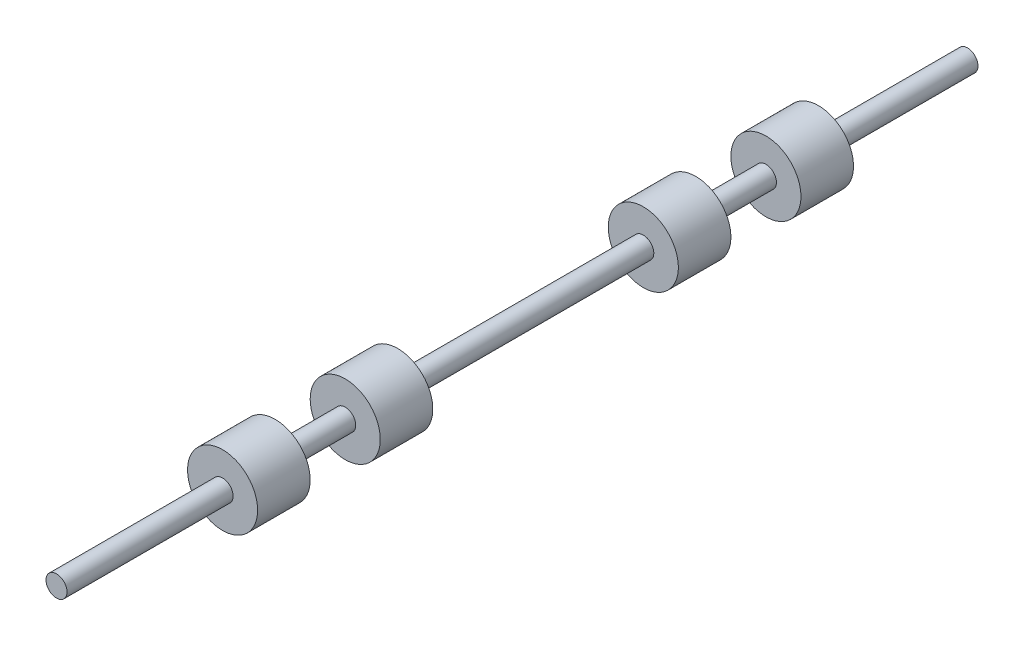
ISO-10303-21;
HEADER;
FILE_DESCRIPTION(('STEP AP214'),'2;1');
FILE_NAME('part.step','',(''),(''),'','','');
FILE_SCHEMA(('AUTOMOTIVE_DESIGN { 1 0 10303 214 1 1 1 1 }'));
ENDSEC;
DATA;
#1=APPLICATION_CONTEXT('core data for automotive mechanical design processes');
#2=APPLICATION_PROTOCOL_DEFINITION('international standard','automotive_design',2000,#1);
#3=PRODUCT_CONTEXT('',#1,'mechanical');
#4=PRODUCT('Part','Part','',(#3));
#5=PRODUCT_RELATED_PRODUCT_CATEGORY('part','',(#4));
#6=PRODUCT_DEFINITION_FORMATION('','',#4);
#7=PRODUCT_DEFINITION_CONTEXT('part definition',#1,'design');
#8=PRODUCT_DEFINITION('design','',#6,#7);
#9=PRODUCT_DEFINITION_SHAPE('','',#8);
#10=(LENGTH_UNIT() NAMED_UNIT(*) SI_UNIT(.MILLI.,.METRE.));
#11=(NAMED_UNIT(*) PLANE_ANGLE_UNIT() SI_UNIT($,.RADIAN.));
#12=(NAMED_UNIT(*) SI_UNIT($,.STERADIAN.) SOLID_ANGLE_UNIT());
#13=UNCERTAINTY_MEASURE_WITH_UNIT(LENGTH_MEASURE(1.E-05),#10,'distance_accuracy_value','');
#14=(GEOMETRIC_REPRESENTATION_CONTEXT(3) GLOBAL_UNCERTAINTY_ASSIGNED_CONTEXT((#13)) GLOBAL_UNIT_ASSIGNED_CONTEXT((#10,
#11,#12)) REPRESENTATION_CONTEXT('',''));
#15=CARTESIAN_POINT('',(0.,0.,0.));
#16=DIRECTION('',(0.,0.,1.));
#17=DIRECTION('',(1.,0.,0.));
#18=AXIS2_PLACEMENT_3D('',#15,#16,#17);
#19=CARTESIAN_POINT('',(0.,0.,26.));
#20=DIRECTION('',(0.,0.,-1.));
#21=DIRECTION('',(-1.,0.,0.));
#22=AXIS2_PLACEMENT_3D('',#19,#20,#21);
#23=CYLINDRICAL_SURFACE('',#22,0.3);
#24=CARTESIAN_POINT('',(0.,0.,17.76));
#25=DIRECTION('',(0.,0.,-1.));
#26=DIRECTION('',(-1.,0.,0.));
#27=AXIS2_PLACEMENT_3D('',#24,#25,#26);
#28=CIRCLE('',#27,0.3);
#29=CARTESIAN_POINT('',(-0.3,0.,17.76));
#30=VERTEX_POINT('',#29);
#31=EDGE_CURVE('E54',#30,#30,#28,.T.);
#32=ORIENTED_EDGE('',*,*,#31,.F.);
#33=EDGE_LOOP('',(#32));
#34=FACE_BOUND('',#33,.T.);
#35=CARTESIAN_POINT('',(0.,0.,19.76));
#36=DIRECTION('',(0.,0.,1.));
#37=DIRECTION('',(1.,0.,0.));
#38=AXIS2_PLACEMENT_3D('',#35,#36,#37);
#39=CIRCLE('',#38,0.3);
#40=CARTESIAN_POINT('',(0.3,0.,19.76));
#41=VERTEX_POINT('',#40);
#42=EDGE_CURVE('E49',#41,#41,#39,.T.);
#43=ORIENTED_EDGE('',*,*,#42,.F.);
#44=EDGE_LOOP('',(#43));
#45=FACE_BOUND('',#44,.T.);
#46=ADVANCED_FACE('F41',(#34,#45),#23,.T.);
#47=CARTESIAN_POINT('',(0.,0.,9.253));
#48=DIRECTION('',(0.,0.,-1.));
#49=DIRECTION('',(-1.,0.,0.));
#50=AXIS2_PLACEMENT_3D('',#47,#48,#49);
#51=CIRCLE('',#50,0.3);
#52=CARTESIAN_POINT('',(-0.3,0.,9.253));
#53=VERTEX_POINT('',#52);
#54=EDGE_CURVE('E65',#53,#53,#51,.T.);
#55=ORIENTED_EDGE('',*,*,#54,.F.);
#56=EDGE_LOOP('',(#55));
#57=FACE_BOUND('',#56,.T.);
#58=CARTESIAN_POINT('',(0.,0.,16.26));
#59=DIRECTION('',(0.,0.,1.));
#60=DIRECTION('',(1.,0.,0.));
#61=AXIS2_PLACEMENT_3D('',#58,#59,#60);
#62=CIRCLE('',#61,0.3);
#63=CARTESIAN_POINT('',(0.3,0.,16.26));
#64=VERTEX_POINT('',#63);
#65=EDGE_CURVE('E59',#64,#64,#62,.T.);
#66=ORIENTED_EDGE('',*,*,#65,.F.);
#67=EDGE_LOOP('',(#66));
#68=FACE_BOUND('',#67,.T.);
#69=ADVANCED_FACE('F141',(#57,#68),#23,.T.);
#70=CARTESIAN_POINT('',(0.,0.,5.753));
#71=DIRECTION('',(0.,0.,-1.));
#72=DIRECTION('',(-1.,0.,0.));
#73=AXIS2_PLACEMENT_3D('',#70,#71,#72);
#74=CIRCLE('',#73,0.3);
#75=CARTESIAN_POINT('',(-0.3,0.,5.753));
#76=VERTEX_POINT('',#75);
#77=EDGE_CURVE('E73',#76,#76,#74,.T.);
#78=ORIENTED_EDGE('',*,*,#77,.F.);
#79=EDGE_LOOP('',(#78));
#80=FACE_BOUND('',#79,.T.);
#81=CARTESIAN_POINT('',(0.,0.,7.753));
#82=DIRECTION('',(0.,0.,1.));
#83=DIRECTION('',(1.,0.,0.));
#84=AXIS2_PLACEMENT_3D('',#81,#82,#83);
#85=CIRCLE('',#84,0.3);
#86=CARTESIAN_POINT('',(0.3,0.,7.753));
#87=VERTEX_POINT('',#86);
#88=EDGE_CURVE('E69',#87,#87,#85,.T.);
#89=ORIENTED_EDGE('',*,*,#88,.F.);
#90=EDGE_LOOP('',(#89));
#91=FACE_BOUND('',#90,.T.);
#92=ADVANCED_FACE('F146',(#80,#91),#23,.T.);
#93=CARTESIAN_POINT('',(0.,0.,5.753));
#94=DIRECTION('',(0.,0.,-1.));
#95=DIRECTION('',(-1.,0.,0.));
#96=AXIS2_PLACEMENT_3D('',#93,#94,#95);
#97=PLANE('',#96);
#98=ORIENTED_EDGE('',*,*,#77,.T.);
#99=EDGE_LOOP('',(#98));
#100=FACE_BOUND('',#99,.T.);
#101=CARTESIAN_POINT('',(0.,0.,5.753));
#102=DIRECTION('',(0.,0.,-1.));
#103=DIRECTION('',(-1.,0.,0.));
#104=AXIS2_PLACEMENT_3D('',#101,#102,#103);
#105=CIRCLE('',#104,1.);
#106=CARTESIAN_POINT('',(-1.,0.,5.753));
#107=VERTEX_POINT('',#106);
#108=EDGE_CURVE('E86',#107,#107,#105,.T.);
#109=ORIENTED_EDGE('',*,*,#108,.F.);
#110=EDGE_LOOP('',(#109));
#111=FACE_BOUND('',#110,.T.);
#112=ADVANCED_FACE('F176',(#100,#111),#97,.F.);
#113=CARTESIAN_POINT('',(0.,0.,0.));
#114=DIRECTION('',(0.,0.,-1.));
#115=DIRECTION('',(-1.,0.,0.));
#116=AXIS2_PLACEMENT_3D('',#113,#114,#115);
#117=CYLINDRICAL_SURFACE('',#116,1.);
#118=CARTESIAN_POINT('',(0.,0.,4.253));
#119=DIRECTION('',(0.,0.,-1.));
#120=DIRECTION('',(-1.,0.,0.));
#121=AXIS2_PLACEMENT_3D('',#118,#119,#120);
#122=CIRCLE('',#121,1.);
#123=CARTESIAN_POINT('',(-1.,0.,4.253));
#124=VERTEX_POINT('',#123);
#125=EDGE_CURVE('E93',#124,#124,#122,.T.);
#126=ORIENTED_EDGE('',*,*,#125,.F.);
#127=EDGE_LOOP('',(#126));
#128=FACE_BOUND('',#127,.T.);
#129=ORIENTED_EDGE('',*,*,#108,.T.);
#130=EDGE_LOOP('',(#129));
#131=FACE_BOUND('',#130,.T.);
#132=ADVANCED_FACE('F181',(#128,#131),#117,.T.);
#133=CARTESIAN_POINT('',(0.,0.,4.253));
#134=DIRECTION('',(0.,0.,1.));
#135=DIRECTION('',(1.,0.,0.));
#136=AXIS2_PLACEMENT_3D('',#133,#134,#135);
#137=PLANE('',#136);
#138=CARTESIAN_POINT('',(0.,0.,4.253));
#139=DIRECTION('',(0.,0.,1.));
#140=DIRECTION('',(1.,0.,0.));
#141=AXIS2_PLACEMENT_3D('',#138,#139,#140);
#142=CIRCLE('',#141,0.3);
#143=CARTESIAN_POINT('',(0.3,0.,4.253));
#144=VERTEX_POINT('',#143);
#145=EDGE_CURVE('E77',#144,#144,#142,.T.);
#146=ORIENTED_EDGE('',*,*,#145,.T.);
#147=EDGE_LOOP('',(#146));
#148=FACE_BOUND('',#147,.T.);
#149=ORIENTED_EDGE('',*,*,#125,.T.);
#150=EDGE_LOOP('',(#149));
#151=FACE_BOUND('',#150,.T.);
#152=ADVANCED_FACE('F172',(#148,#151),#137,.F.);
#153=CARTESIAN_POINT('',(0.,0.,0.));
#154=DIRECTION('',(0.,0.,1.));
#155=DIRECTION('',(1.,0.,0.));
#156=AXIS2_PLACEMENT_3D('',#153,#154,#155);
#157=PLANE('',#156);
#158=CARTESIAN_POINT('',(0.,0.,0.));
#159=DIRECTION('',(0.,0.,1.));
#160=DIRECTION('',(1.,0.,0.));
#161=AXIS2_PLACEMENT_3D('',#158,#159,#160);
#162=CIRCLE('',#161,0.3);
#163=CARTESIAN_POINT('',(0.3,0.,0.));
#164=VERTEX_POINT('',#163);
#165=EDGE_CURVE('E82',#164,#164,#162,.T.);
#166=ORIENTED_EDGE('',*,*,#165,.F.);
#167=EDGE_LOOP('',(#166));
#168=FACE_BOUND('',#167,.T.);
#169=ADVANCED_FACE('F163',(#168),#157,.F.);
#170=ORIENTED_EDGE('',*,*,#165,.T.);
#171=EDGE_LOOP('',(#170));
#172=FACE_BOUND('',#171,.T.);
#173=ORIENTED_EDGE('',*,*,#145,.F.);
#174=EDGE_LOOP('',(#173));
#175=FACE_BOUND('',#174,.T.);
#176=ADVANCED_FACE('F153',(#172,#175),#23,.T.);
#177=CARTESIAN_POINT('',(0.,0.,9.253));
#178=DIRECTION('',(0.,0.,-1.));
#179=DIRECTION('',(-1.,0.,0.));
#180=AXIS2_PLACEMENT_3D('',#177,#178,#179);
#181=PLANE('',#180);
#182=ORIENTED_EDGE('',*,*,#54,.T.);
#183=EDGE_LOOP('',(#182));
#184=FACE_BOUND('',#183,.T.);
#185=CARTESIAN_POINT('',(0.,0.,9.253));
#186=DIRECTION('',(0.,0.,-1.));
#187=DIRECTION('',(-1.,0.,0.));
#188=AXIS2_PLACEMENT_3D('',#185,#186,#187);
#189=CIRCLE('',#188,1.);
#190=CARTESIAN_POINT('',(-1.,0.,9.253));
#191=VERTEX_POINT('',#190);
#192=EDGE_CURVE('E97',#191,#191,#189,.T.);
#193=ORIENTED_EDGE('',*,*,#192,.F.);
#194=EDGE_LOOP('',(#193));
#195=FACE_BOUND('',#194,.T.);
#196=ADVANCED_FACE('F162',(#184,#195),#181,.F.);
#197=CARTESIAN_POINT('',(0.,0.,0.));
#198=DIRECTION('',(0.,0.,-1.));
#199=DIRECTION('',(-1.,0.,0.));
#200=AXIS2_PLACEMENT_3D('',#197,#198,#199);
#201=CYLINDRICAL_SURFACE('',#200,1.);
#202=CARTESIAN_POINT('',(0.,0.,7.753));
#203=DIRECTION('',(0.,0.,-1.));
#204=DIRECTION('',(-1.,0.,0.));
#205=AXIS2_PLACEMENT_3D('',#202,#203,#204);
#206=CIRCLE('',#205,1.);
#207=CARTESIAN_POINT('',(-1.,0.,7.753));
#208=VERTEX_POINT('',#207);
#209=EDGE_CURVE('E101',#208,#208,#206,.T.);
#210=ORIENTED_EDGE('',*,*,#209,.F.);
#211=EDGE_LOOP('',(#210));
#212=FACE_BOUND('',#211,.T.);
#213=ORIENTED_EDGE('',*,*,#192,.T.);
#214=EDGE_LOOP('',(#213));
#215=FACE_BOUND('',#214,.T.);
#216=ADVANCED_FACE('F169',(#212,#215),#201,.T.);
#217=CARTESIAN_POINT('',(0.,0.,7.753));
#218=DIRECTION('',(0.,0.,1.));
#219=DIRECTION('',(1.,0.,0.));
#220=AXIS2_PLACEMENT_3D('',#217,#218,#219);
#221=PLANE('',#220);
#222=ORIENTED_EDGE('',*,*,#88,.T.);
#223=EDGE_LOOP('',(#222));
#224=FACE_BOUND('',#223,.T.);
#225=ORIENTED_EDGE('',*,*,#209,.T.);
#226=EDGE_LOOP('',(#225));
#227=FACE_BOUND('',#226,.T.);
#228=ADVANCED_FACE('F188',(#224,#227),#221,.F.);
#229=CARTESIAN_POINT('',(0.,0.,17.76));
#230=DIRECTION('',(0.,0.,-1.));
#231=DIRECTION('',(-1.,0.,0.));
#232=AXIS2_PLACEMENT_3D('',#229,#230,#231);
#233=PLANE('',#232);
#234=ORIENTED_EDGE('',*,*,#31,.T.);
#235=EDGE_LOOP('',(#234));
#236=FACE_BOUND('',#235,.T.);
#237=CARTESIAN_POINT('',(0.,0.,17.76));
#238=DIRECTION('',(0.,0.,-1.));
#239=DIRECTION('',(-1.,0.,0.));
#240=AXIS2_PLACEMENT_3D('',#237,#238,#239);
#241=CIRCLE('',#240,1.);
#242=CARTESIAN_POINT('',(-1.,0.,17.76));
#243=VERTEX_POINT('',#242);
#244=EDGE_CURVE('E105',#243,#243,#241,.T.);
#245=ORIENTED_EDGE('',*,*,#244,.F.);
#246=EDGE_LOOP('',(#245));
#247=FACE_BOUND('',#246,.T.);
#248=ADVANCED_FACE('F191',(#236,#247),#233,.F.);
#249=CARTESIAN_POINT('',(0.,0.,0.));
#250=DIRECTION('',(0.,0.,-1.));
#251=DIRECTION('',(-1.,0.,0.));
#252=AXIS2_PLACEMENT_3D('',#249,#250,#251);
#253=CYLINDRICAL_SURFACE('',#252,1.);
#254=CARTESIAN_POINT('',(0.,0.,16.26));
#255=DIRECTION('',(0.,0.,-1.));
#256=DIRECTION('',(-1.,0.,0.));
#257=AXIS2_PLACEMENT_3D('',#254,#255,#256);
#258=CIRCLE('',#257,1.);
#259=CARTESIAN_POINT('',(-1.,0.,16.26));
#260=VERTEX_POINT('',#259);
#261=EDGE_CURVE('E109',#260,#260,#258,.T.);
#262=ORIENTED_EDGE('',*,*,#261,.F.);
#263=EDGE_LOOP('',(#262));
#264=FACE_BOUND('',#263,.T.);
#265=ORIENTED_EDGE('',*,*,#244,.T.);
#266=EDGE_LOOP('',(#265));
#267=FACE_BOUND('',#266,.T.);
#268=ADVANCED_FACE('F137',(#264,#267),#253,.T.);
#269=CARTESIAN_POINT('',(0.,0.,16.26));
#270=DIRECTION('',(0.,0.,1.));
#271=DIRECTION('',(1.,0.,0.));
#272=AXIS2_PLACEMENT_3D('',#269,#270,#271);
#273=PLANE('',#272);
#274=ORIENTED_EDGE('',*,*,#65,.T.);
#275=EDGE_LOOP('',(#274));
#276=FACE_BOUND('',#275,.T.);
#277=ORIENTED_EDGE('',*,*,#261,.T.);
#278=EDGE_LOOP('',(#277));
#279=FACE_BOUND('',#278,.T.);
#280=ADVANCED_FACE('F132',(#276,#279),#273,.F.);
#281=CARTESIAN_POINT('',(0.,0.,21.26));
#282=DIRECTION('',(0.,0.,-1.));
#283=DIRECTION('',(-1.,0.,0.));
#284=AXIS2_PLACEMENT_3D('',#281,#282,#283);
#285=PLANE('',#284);
#286=CARTESIAN_POINT('',(0.,0.,21.26));
#287=DIRECTION('',(0.,0.,-1.));
#288=DIRECTION('',(-1.,0.,0.));
#289=AXIS2_PLACEMENT_3D('',#286,#287,#288);
#290=CIRCLE('',#289,0.3);
#291=CARTESIAN_POINT('',(-0.3,0.,21.26));
#292=VERTEX_POINT('',#291);
#293=EDGE_CURVE('E10',#292,#292,#290,.T.);
#294=ORIENTED_EDGE('',*,*,#293,.T.);
#295=EDGE_LOOP('',(#294));
#296=FACE_BOUND('',#295,.T.);
#297=CARTESIAN_POINT('',(0.,0.,21.26));
#298=DIRECTION('',(0.,0.,-1.));
#299=DIRECTION('',(-1.,0.,0.));
#300=AXIS2_PLACEMENT_3D('',#297,#298,#299);
#301=CIRCLE('',#300,1.);
#302=CARTESIAN_POINT('',(-1.,0.,21.26));
#303=VERTEX_POINT('',#302);
#304=EDGE_CURVE('E113',#303,#303,#301,.T.);
#305=ORIENTED_EDGE('',*,*,#304,.F.);
#306=EDGE_LOOP('',(#305));
#307=FACE_BOUND('',#306,.T.);
#308=ADVANCED_FACE('F127',(#296,#307),#285,.F.);
#309=CARTESIAN_POINT('',(0.,0.,0.));
#310=DIRECTION('',(0.,0.,-1.));
#311=DIRECTION('',(-1.,0.,0.));
#312=AXIS2_PLACEMENT_3D('',#309,#310,#311);
#313=CYLINDRICAL_SURFACE('',#312,1.);
#314=CARTESIAN_POINT('',(0.,0.,19.76));
#315=DIRECTION('',(0.,0.,-1.));
#316=DIRECTION('',(-1.,0.,0.));
#317=AXIS2_PLACEMENT_3D('',#314,#315,#316);
#318=CIRCLE('',#317,1.);
#319=CARTESIAN_POINT('',(-1.,0.,19.76));
#320=VERTEX_POINT('',#319);
#321=EDGE_CURVE('E117',#320,#320,#318,.T.);
#322=ORIENTED_EDGE('',*,*,#321,.F.);
#323=EDGE_LOOP('',(#322));
#324=FACE_BOUND('',#323,.T.);
#325=ORIENTED_EDGE('',*,*,#304,.T.);
#326=EDGE_LOOP('',(#325));
#327=FACE_BOUND('',#326,.T.);
#328=ADVANCED_FACE('F124',(#324,#327),#313,.T.);
#329=CARTESIAN_POINT('',(0.,0.,19.76));
#330=DIRECTION('',(0.,0.,1.));
#331=DIRECTION('',(1.,0.,0.));
#332=AXIS2_PLACEMENT_3D('',#329,#330,#331);
#333=PLANE('',#332);
#334=ORIENTED_EDGE('',*,*,#42,.T.);
#335=EDGE_LOOP('',(#334));
#336=FACE_BOUND('',#335,.T.);
#337=ORIENTED_EDGE('',*,*,#321,.T.);
#338=EDGE_LOOP('',(#337));
#339=FACE_BOUND('',#338,.T.);
#340=ADVANCED_FACE('F122',(#336,#339),#333,.F.);
#341=CARTESIAN_POINT('',(0.,0.,26.));
#342=DIRECTION('',(0.,0.,1.));
#343=DIRECTION('',(1.,0.,0.));
#344=AXIS2_PLACEMENT_3D('',#341,#342,#343);
#345=PLANE('',#344);
#346=CARTESIAN_POINT('',(0.,0.,26.));
#347=DIRECTION('',(0.,0.,1.));
#348=DIRECTION('',(1.,0.,0.));
#349=AXIS2_PLACEMENT_3D('',#346,#347,#348);
#350=CIRCLE('',#349,0.3);
#351=CARTESIAN_POINT('',(0.3,0.,26.));
#352=VERTEX_POINT('',#351);
#353=EDGE_CURVE('E81',#352,#352,#350,.T.);
#354=ORIENTED_EDGE('',*,*,#353,.T.);
#355=EDGE_LOOP('',(#354));
#356=FACE_BOUND('',#355,.T.);
#357=ADVANCED_FACE('F151',(#356),#345,.T.);
#358=ORIENTED_EDGE('',*,*,#353,.F.);
#359=EDGE_LOOP('',(#358));
#360=FACE_BOUND('',#359,.T.);
#361=ORIENTED_EDGE('',*,*,#293,.F.);
#362=EDGE_LOOP('',(#361));
#363=FACE_BOUND('',#362,.T.);
#364=ADVANCED_FACE('F43',(#360,#363),#23,.T.);
#365=CLOSED_SHELL('',(#46,#69,#92,#112,#132,#152,#169,#176,#196,#216,#228,#248,#268,#280,#308,
#328,#340,#357,#364));
#366=MANIFOLD_SOLID_BREP('B2',#365);
#367=ADVANCED_BREP_SHAPE_REPRESENTATION('',(#18,#366),#14);
#368=SHAPE_DEFINITION_REPRESENTATION(#9,#367);
ENDSEC;
END-ISO-10303-21;
